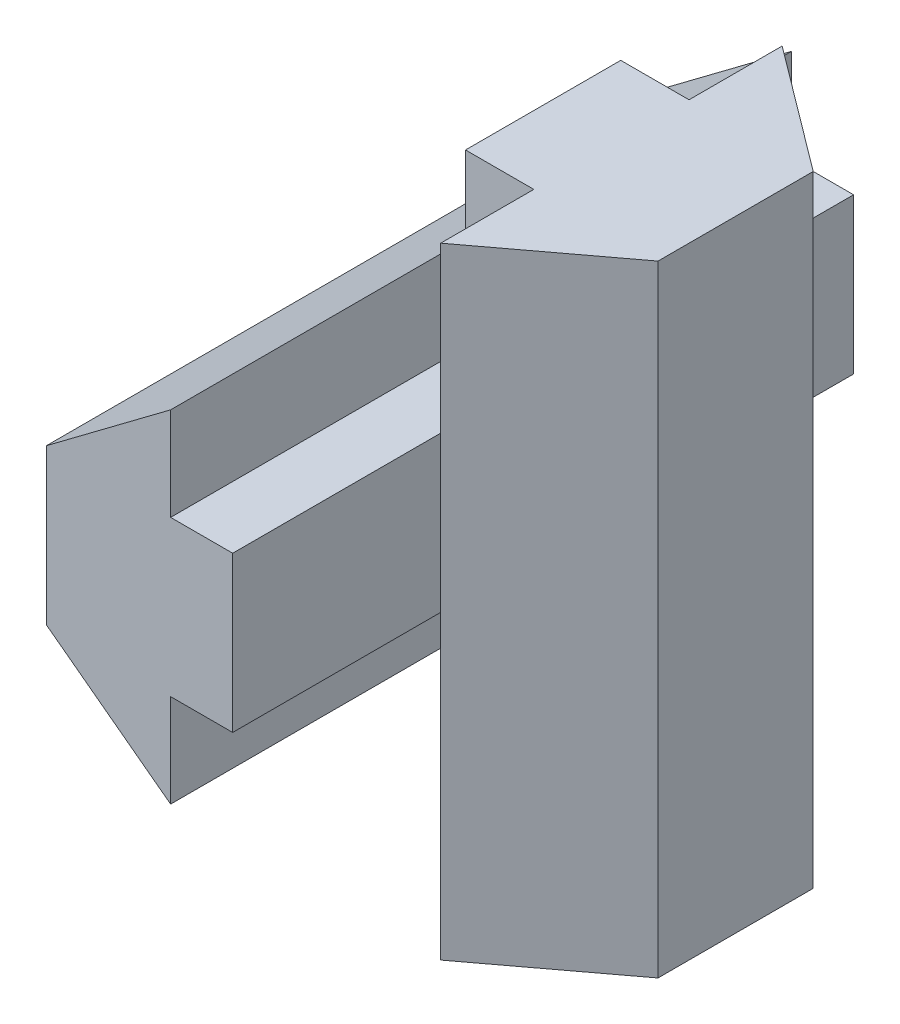
ISO-10303-21;
HEADER;
FILE_DESCRIPTION(('STEP AP214'),'2;1');
FILE_NAME('part.step','',(''),(''),'','','');
FILE_SCHEMA(('AUTOMOTIVE_DESIGN { 1 0 10303 214 1 1 1 1 }'));
ENDSEC;
DATA;
#1=APPLICATION_CONTEXT('core data for automotive mechanical design processes');
#2=APPLICATION_PROTOCOL_DEFINITION('international standard','automotive_design',2000,#1);
#3=PRODUCT_CONTEXT('',#1,'mechanical');
#4=PRODUCT('Part','Part','',(#3));
#5=PRODUCT_RELATED_PRODUCT_CATEGORY('part','',(#4));
#6=PRODUCT_DEFINITION_FORMATION('','',#4);
#7=PRODUCT_DEFINITION_CONTEXT('part definition',#1,'design');
#8=PRODUCT_DEFINITION('design','',#6,#7);
#9=PRODUCT_DEFINITION_SHAPE('','',#8);
#10=(LENGTH_UNIT() NAMED_UNIT(*) SI_UNIT(.MILLI.,.METRE.));
#11=(NAMED_UNIT(*) PLANE_ANGLE_UNIT() SI_UNIT($,.RADIAN.));
#12=(NAMED_UNIT(*) SI_UNIT($,.STERADIAN.) SOLID_ANGLE_UNIT());
#13=UNCERTAINTY_MEASURE_WITH_UNIT(LENGTH_MEASURE(1.E-05),#10,'distance_accuracy_value','');
#14=(GEOMETRIC_REPRESENTATION_CONTEXT(3) GLOBAL_UNCERTAINTY_ASSIGNED_CONTEXT((#13)) GLOBAL_UNIT_ASSIGNED_CONTEXT((#10,
#11,#12)) REPRESENTATION_CONTEXT('',''));
#15=CARTESIAN_POINT('',(0.,0.,0.));
#16=DIRECTION('',(0.,0.,1.));
#17=DIRECTION('',(1.,0.,0.));
#18=AXIS2_PLACEMENT_3D('',#15,#16,#17);
#19=CARTESIAN_POINT('',(6.,2.5,10.));
#20=DIRECTION('',(-1.,0.,0.));
#21=DIRECTION('',(0.,-1.,0.));
#22=AXIS2_PLACEMENT_3D('',#19,#20,#21);
#23=PLANE('',#22);
#24=DIRECTION('',(0.,-1.,0.));
#25=VECTOR('',#24,1.);
#26=CARTESIAN_POINT('',(6.,10.,2.5));
#27=LINE('',#26,#25);
#28=CARTESIAN_POINT('',(6.,2.5,2.5));
#29=VERTEX_POINT('',#28);
#30=CARTESIAN_POINT('',(6.,-2.5,2.5));
#31=VERTEX_POINT('',#30);
#32=EDGE_CURVE('E11',#29,#31,#27,.T.);
#33=ORIENTED_EDGE('',*,*,#32,.F.);
#34=DIRECTION('',(0.,0.,-1.));
#35=VECTOR('',#34,1.);
#36=CARTESIAN_POINT('',(6.,2.5,10.));
#37=LINE('',#36,#35);
#38=CARTESIAN_POINT('',(6.,2.5,10.));
#39=VERTEX_POINT('',#38);
#40=EDGE_CURVE('E168',#39,#29,#37,.T.);
#41=ORIENTED_EDGE('',*,*,#40,.F.);
#42=DIRECTION('',(0.,1.,0.));
#43=VECTOR('',#42,1.);
#44=CARTESIAN_POINT('',(6.,2.5,10.));
#45=LINE('',#44,#43);
#46=CARTESIAN_POINT('',(6.,-2.5,10.));
#47=VERTEX_POINT('',#46);
#48=EDGE_CURVE('E297',#47,#39,#45,.T.);
#49=ORIENTED_EDGE('',*,*,#48,.F.);
#50=DIRECTION('',(0.,0.,-1.));
#51=VECTOR('',#50,1.);
#52=CARTESIAN_POINT('',(6.,-2.5,10.));
#53=LINE('',#52,#51);
#54=EDGE_CURVE('E173',#47,#31,#53,.T.);
#55=ORIENTED_EDGE('',*,*,#54,.T.);
#56=EDGE_LOOP('',(#33,#41,#49,#55));
#57=FACE_BOUND('',#56,.T.);
#58=ADVANCED_FACE('F33',(#57),#23,.F.);
#59=CARTESIAN_POINT('',(0.,-2.5,10.));
#60=DIRECTION('',(0.6,0.8,0.));
#61=DIRECTION('',(-0.8,0.6,0.));
#62=AXIS2_PLACEMENT_3D('',#59,#60,#61);
#63=PLANE('',#62);
#64=DIRECTION('',(0.8,-0.6,0.));
#65=VECTOR('',#64,1.);
#66=CARTESIAN_POINT('',(0.,-2.5,-10.));
#67=LINE('',#66,#65);
#68=CARTESIAN_POINT('',(0.,-2.5,-10.));
#69=VERTEX_POINT('',#68);
#70=CARTESIAN_POINT('',(4.,-5.5,-10.));
#71=VERTEX_POINT('',#70);
#72=EDGE_CURVE('E146',#69,#71,#67,.T.);
#73=ORIENTED_EDGE('',*,*,#72,.T.);
#74=DIRECTION('',(0.,0.,-1.));
#75=VECTOR('',#74,1.);
#76=CARTESIAN_POINT('',(4.,-5.5,10.));
#77=LINE('',#76,#75);
#78=CARTESIAN_POINT('',(4.,-5.5,10.));
#79=VERTEX_POINT('',#78);
#80=EDGE_CURVE('E37',#79,#71,#77,.T.);
#81=ORIENTED_EDGE('',*,*,#80,.F.);
#82=DIRECTION('',(0.8,-0.6,0.));
#83=VECTOR('',#82,1.);
#84=CARTESIAN_POINT('',(0.,-2.5,10.));
#85=LINE('',#84,#83);
#86=CARTESIAN_POINT('',(0.,-2.5,10.));
#87=VERTEX_POINT('',#86);
#88=EDGE_CURVE('E163',#87,#79,#85,.T.);
#89=ORIENTED_EDGE('',*,*,#88,.F.);
#90=DIRECTION('',(0.,0.,-1.));
#91=VECTOR('',#90,1.);
#92=CARTESIAN_POINT('',(0.,-2.5,10.));
#93=LINE('',#92,#91);
#94=EDGE_CURVE('E142',#87,#69,#93,.T.);
#95=ORIENTED_EDGE('',*,*,#94,.T.);
#96=EDGE_LOOP('',(#73,#81,#89,#95));
#97=FACE_BOUND('',#96,.T.);
#98=ADVANCED_FACE('F35',(#97),#63,.F.);
#99=CARTESIAN_POINT('',(4.,-2.5,10.));
#100=DIRECTION('',(-1.,0.,0.));
#101=DIRECTION('',(0.,0.,1.));
#102=AXIS2_PLACEMENT_3D('',#99,#100,#101);
#103=PLANE('',#102);
#104=DIRECTION('',(0.,1.,0.));
#105=VECTOR('',#104,1.);
#106=CARTESIAN_POINT('',(4.,-2.5,-10.));
#107=LINE('',#106,#105);
#108=CARTESIAN_POINT('',(4.,-2.5,-10.));
#109=VERTEX_POINT('',#108);
#110=EDGE_CURVE('E149',#71,#109,#107,.T.);
#111=ORIENTED_EDGE('',*,*,#110,.T.);
#112=DIRECTION('',(0.,0.,-1.));
#113=VECTOR('',#112,1.);
#114=CARTESIAN_POINT('',(4.,-2.5,10.));
#115=LINE('',#114,#113);
#116=CARTESIAN_POINT('',(4.,-2.5,10.));
#117=VERTEX_POINT('',#116);
#118=EDGE_CURVE('E175',#117,#109,#115,.T.);
#119=ORIENTED_EDGE('',*,*,#118,.F.);
#120=DIRECTION('',(0.,1.,0.));
#121=VECTOR('',#120,1.);
#122=CARTESIAN_POINT('',(4.,-2.5,10.));
#123=LINE('',#122,#121);
#124=EDGE_CURVE('E103',#79,#117,#123,.T.);
#125=ORIENTED_EDGE('',*,*,#124,.F.);
#126=ORIENTED_EDGE('',*,*,#80,.T.);
#127=EDGE_LOOP('',(#111,#119,#125,#126));
#128=FACE_BOUND('',#127,.T.);
#129=ADVANCED_FACE('F312',(#128),#103,.F.);
#130=CARTESIAN_POINT('',(6.,-2.5,10.));
#131=DIRECTION('',(0.,1.,0.));
#132=DIRECTION('',(0.,0.,1.));
#133=AXIS2_PLACEMENT_3D('',#130,#131,#132);
#134=PLANE('',#133);
#135=DIRECTION('',(1.,0.,0.));
#136=VECTOR('',#135,1.);
#137=CARTESIAN_POINT('',(6.,-2.5,-10.));
#138=LINE('',#137,#136);
#139=CARTESIAN_POINT('',(6.,-2.5,-10.));
#140=VERTEX_POINT('',#139);
#141=EDGE_CURVE('E151',#109,#140,#138,.T.);
#142=ORIENTED_EDGE('',*,*,#141,.T.);
#143=CARTESIAN_POINT('',(6.,-2.5,-2.5));
#144=VERTEX_POINT('',#143);
#145=EDGE_CURVE('E171',#144,#140,#53,.T.);
#146=ORIENTED_EDGE('',*,*,#145,.F.);
#147=EDGE_CURVE('E176',#31,#144,#53,.T.);
#148=ORIENTED_EDGE('',*,*,#147,.F.);
#149=ORIENTED_EDGE('',*,*,#54,.F.);
#150=DIRECTION('',(1.,0.,0.));
#151=VECTOR('',#150,1.);
#152=CARTESIAN_POINT('',(6.,-2.5,10.));
#153=LINE('',#152,#151);
#154=EDGE_CURVE('E295',#117,#47,#153,.T.);
#155=ORIENTED_EDGE('',*,*,#154,.F.);
#156=ORIENTED_EDGE('',*,*,#118,.T.);
#157=EDGE_LOOP('',(#142,#146,#148,#149,#155,#156));
#158=FACE_BOUND('',#157,.T.);
#159=ADVANCED_FACE('F313',(#158),#134,.F.);
#160=CARTESIAN_POINT('',(6.,2.5,-2.5));
#161=VERTEX_POINT('',#160);
#162=CARTESIAN_POINT('',(6.,2.5,-10.));
#163=VERTEX_POINT('',#162);
#164=EDGE_CURVE('E167',#161,#163,#37,.T.);
#165=ORIENTED_EDGE('',*,*,#164,.F.);
#166=DIRECTION('',(0.,-1.,0.));
#167=VECTOR('',#166,1.);
#168=CARTESIAN_POINT('',(6.,10.,-2.5));
#169=LINE('',#168,#167);
#170=EDGE_CURVE('E42',#161,#144,#169,.T.);
#171=ORIENTED_EDGE('',*,*,#170,.T.);
#172=ORIENTED_EDGE('',*,*,#145,.T.);
#173=DIRECTION('',(0.,1.,0.));
#174=VECTOR('',#173,1.);
#175=CARTESIAN_POINT('',(6.,2.5,-10.));
#176=LINE('',#175,#174);
#177=EDGE_CURVE('E154',#140,#163,#176,.T.);
#178=ORIENTED_EDGE('',*,*,#177,.T.);
#179=EDGE_LOOP('',(#165,#171,#172,#178));
#180=FACE_BOUND('',#179,.T.);
#181=ADVANCED_FACE('F375',(#180),#23,.F.);
#182=CARTESIAN_POINT('',(4.,2.5,10.));
#183=DIRECTION('',(0.,-1.,0.));
#184=DIRECTION('',(0.,0.,-1.));
#185=AXIS2_PLACEMENT_3D('',#182,#183,#184);
#186=PLANE('',#185);
#187=DIRECTION('',(-1.,0.,0.));
#188=VECTOR('',#187,1.);
#189=CARTESIAN_POINT('',(4.,2.5,-10.));
#190=LINE('',#189,#188);
#191=CARTESIAN_POINT('',(4.,2.5,-10.));
#192=VERTEX_POINT('',#191);
#193=EDGE_CURVE('E157',#163,#192,#190,.T.);
#194=ORIENTED_EDGE('',*,*,#193,.T.);
#195=DIRECTION('',(0.,0.,-1.));
#196=VECTOR('',#195,1.);
#197=CARTESIAN_POINT('',(4.,2.5,10.));
#198=LINE('',#197,#196);
#199=CARTESIAN_POINT('',(4.,2.5,10.));
#200=VERTEX_POINT('',#199);
#201=EDGE_CURVE('E137',#200,#192,#198,.T.);
#202=ORIENTED_EDGE('',*,*,#201,.F.);
#203=DIRECTION('',(-1.,0.,0.));
#204=VECTOR('',#203,1.);
#205=CARTESIAN_POINT('',(4.,2.5,10.));
#206=LINE('',#205,#204);
#207=EDGE_CURVE('E125',#39,#200,#206,.T.);
#208=ORIENTED_EDGE('',*,*,#207,.F.);
#209=ORIENTED_EDGE('',*,*,#40,.T.);
#210=EDGE_CURVE('E172',#29,#161,#37,.T.);
#211=ORIENTED_EDGE('',*,*,#210,.T.);
#212=ORIENTED_EDGE('',*,*,#164,.T.);
#213=EDGE_LOOP('',(#194,#202,#208,#209,#211,#212));
#214=FACE_BOUND('',#213,.T.);
#215=ADVANCED_FACE('F303',(#214),#186,.F.);
#216=CARTESIAN_POINT('',(4.,5.5,10.));
#217=DIRECTION('',(-1.,0.,0.));
#218=DIRECTION('',(0.,0.,1.));
#219=AXIS2_PLACEMENT_3D('',#216,#217,#218);
#220=PLANE('',#219);
#221=DIRECTION('',(0.,1.,0.));
#222=VECTOR('',#221,1.);
#223=CARTESIAN_POINT('',(4.,5.5,-10.));
#224=LINE('',#223,#222);
#225=CARTESIAN_POINT('',(4.,5.5,-10.));
#226=VERTEX_POINT('',#225);
#227=EDGE_CURVE('E134',#192,#226,#224,.T.);
#228=ORIENTED_EDGE('',*,*,#227,.T.);
#229=DIRECTION('',(0.,0.,-1.));
#230=VECTOR('',#229,1.);
#231=CARTESIAN_POINT('',(4.,5.5,10.));
#232=LINE('',#231,#230);
#233=CARTESIAN_POINT('',(4.,5.5,10.));
#234=VERTEX_POINT('',#233);
#235=EDGE_CURVE('E131',#234,#226,#232,.T.);
#236=ORIENTED_EDGE('',*,*,#235,.F.);
#237=DIRECTION('',(0.,1.,0.));
#238=VECTOR('',#237,1.);
#239=CARTESIAN_POINT('',(4.,5.5,10.));
#240=LINE('',#239,#238);
#241=EDGE_CURVE('E118',#200,#234,#240,.T.);
#242=ORIENTED_EDGE('',*,*,#241,.F.);
#243=ORIENTED_EDGE('',*,*,#201,.T.);
#244=EDGE_LOOP('',(#228,#236,#242,#243));
#245=FACE_BOUND('',#244,.T.);
#246=ADVANCED_FACE('F132',(#245),#220,.F.);
#247=CARTESIAN_POINT('',(0.,2.5,10.));
#248=DIRECTION('',(0.6,-0.8,0.));
#249=DIRECTION('',(0.8,0.6,0.));
#250=AXIS2_PLACEMENT_3D('',#247,#248,#249);
#251=PLANE('',#250);
#252=DIRECTION('',(-0.8,-0.6,0.));
#253=VECTOR('',#252,1.);
#254=CARTESIAN_POINT('',(0.,2.5,-10.));
#255=LINE('',#254,#253);
#256=CARTESIAN_POINT('',(0.,2.5,-10.));
#257=VERTEX_POINT('',#256);
#258=EDGE_CURVE('E160',#226,#257,#255,.T.);
#259=ORIENTED_EDGE('',*,*,#258,.T.);
#260=DIRECTION('',(0.,0.,-1.));
#261=VECTOR('',#260,1.);
#262=CARTESIAN_POINT('',(0.,2.5,10.));
#263=LINE('',#262,#261);
#264=CARTESIAN_POINT('',(0.,2.5,10.));
#265=VERTEX_POINT('',#264);
#266=EDGE_CURVE('E138',#265,#257,#263,.T.);
#267=ORIENTED_EDGE('',*,*,#266,.F.);
#268=DIRECTION('',(-0.8,-0.6,0.));
#269=VECTOR('',#268,1.);
#270=CARTESIAN_POINT('',(0.,2.5,10.));
#271=LINE('',#270,#269);
#272=EDGE_CURVE('E122',#234,#265,#271,.T.);
#273=ORIENTED_EDGE('',*,*,#272,.F.);
#274=ORIENTED_EDGE('',*,*,#235,.T.);
#275=EDGE_LOOP('',(#259,#267,#273,#274));
#276=FACE_BOUND('',#275,.T.);
#277=ADVANCED_FACE('F140',(#276),#251,.F.);
#278=CARTESIAN_POINT('',(0.,-2.5,10.));
#279=DIRECTION('',(1.,0.,0.));
#280=DIRECTION('',(0.,0.,-1.));
#281=AXIS2_PLACEMENT_3D('',#278,#279,#280);
#282=PLANE('',#281);
#283=DIRECTION('',(0.,-1.,0.));
#284=VECTOR('',#283,1.);
#285=CARTESIAN_POINT('',(0.,-2.5,-10.));
#286=LINE('',#285,#284);
#287=EDGE_CURVE('E94',#257,#69,#286,.T.);
#288=ORIENTED_EDGE('',*,*,#287,.T.);
#289=ORIENTED_EDGE('',*,*,#94,.F.);
#290=DIRECTION('',(0.,-1.,0.));
#291=VECTOR('',#290,1.);
#292=CARTESIAN_POINT('',(0.,-2.5,10.));
#293=LINE('',#292,#291);
#294=EDGE_CURVE('E61',#265,#87,#293,.T.);
#295=ORIENTED_EDGE('',*,*,#294,.F.);
#296=ORIENTED_EDGE('',*,*,#266,.T.);
#297=EDGE_LOOP('',(#288,#289,#295,#296));
#298=FACE_BOUND('',#297,.T.);
#299=ADVANCED_FACE('F309',(#298),#282,.F.);
#300=CARTESIAN_POINT('',(0.,0.,10.));
#301=DIRECTION('',(0.,0.,1.));
#302=DIRECTION('',(1.,0.,0.));
#303=AXIS2_PLACEMENT_3D('',#300,#301,#302);
#304=PLANE('',#303);
#305=ORIENTED_EDGE('',*,*,#88,.T.);
#306=ORIENTED_EDGE('',*,*,#124,.T.);
#307=ORIENTED_EDGE('',*,*,#154,.T.);
#308=ORIENTED_EDGE('',*,*,#48,.T.);
#309=ORIENTED_EDGE('',*,*,#207,.T.);
#310=ORIENTED_EDGE('',*,*,#241,.T.);
#311=ORIENTED_EDGE('',*,*,#272,.T.);
#312=ORIENTED_EDGE('',*,*,#294,.T.);
#313=EDGE_LOOP('',(#305,#306,#307,#308,#309,#310,#311,#312));
#314=FACE_BOUND('',#313,.T.);
#315=ADVANCED_FACE('F120',(#314),#304,.T.);
#316=CARTESIAN_POINT('',(0.,0.,-10.));
#317=DIRECTION('',(0.,0.,1.));
#318=DIRECTION('',(1.,0.,0.));
#319=AXIS2_PLACEMENT_3D('',#316,#317,#318);
#320=PLANE('',#319);
#321=ORIENTED_EDGE('',*,*,#72,.F.);
#322=ORIENTED_EDGE('',*,*,#287,.F.);
#323=ORIENTED_EDGE('',*,*,#258,.F.);
#324=ORIENTED_EDGE('',*,*,#227,.F.);
#325=ORIENTED_EDGE('',*,*,#193,.F.);
#326=ORIENTED_EDGE('',*,*,#177,.F.);
#327=ORIENTED_EDGE('',*,*,#141,.F.);
#328=ORIENTED_EDGE('',*,*,#110,.F.);
#329=EDGE_LOOP('',(#321,#322,#323,#324,#325,#326,#327,#328));
#330=FACE_BOUND('',#329,.T.);
#331=ADVANCED_FACE('F307',(#330),#320,.F.);
#332=CARTESIAN_POINT('',(6.,10.,2.5));
#333=DIRECTION('',(1.,0.,0.));
#334=DIRECTION('',(0.,0.,-1.));
#335=AXIS2_PLACEMENT_3D('',#332,#333,#334);
#336=PLANE('',#335);
#337=CARTESIAN_POINT('',(6.,-10.,2.5));
#338=VERTEX_POINT('',#337);
#339=EDGE_CURVE('E45',#31,#338,#27,.T.);
#340=ORIENTED_EDGE('',*,*,#339,.F.);
#341=ORIENTED_EDGE('',*,*,#147,.T.);
#342=CARTESIAN_POINT('',(6.,-10.,-2.5));
#343=VERTEX_POINT('',#342);
#344=EDGE_CURVE('E52',#144,#343,#169,.T.);
#345=ORIENTED_EDGE('',*,*,#344,.T.);
#346=DIRECTION('',(0.,0.,1.));
#347=VECTOR('',#346,1.);
#348=CARTESIAN_POINT('',(6.,-10.,2.5));
#349=LINE('',#348,#347);
#350=EDGE_CURVE('E209',#343,#338,#349,.T.);
#351=ORIENTED_EDGE('',*,*,#350,.T.);
#352=EDGE_LOOP('',(#340,#341,#345,#351));
#353=FACE_BOUND('',#352,.T.);
#354=ADVANCED_FACE('F362',(#353),#336,.F.);
#355=ORIENTED_EDGE('',*,*,#210,.F.);
#356=CARTESIAN_POINT('',(6.,10.,2.5));
#357=VERTEX_POINT('',#356);
#358=EDGE_CURVE('E44',#357,#29,#27,.T.);
#359=ORIENTED_EDGE('',*,*,#358,.F.);
#360=DIRECTION('',(0.,0.,1.));
#361=VECTOR('',#360,1.);
#362=CARTESIAN_POINT('',(6.,10.,2.5));
#363=LINE('',#362,#361);
#364=CARTESIAN_POINT('',(6.,10.,-2.5));
#365=VERTEX_POINT('',#364);
#366=EDGE_CURVE('E229',#365,#357,#363,.T.);
#367=ORIENTED_EDGE('',*,*,#366,.F.);
#368=EDGE_CURVE('E184',#365,#161,#169,.T.);
#369=ORIENTED_EDGE('',*,*,#368,.T.);
#370=EDGE_LOOP('',(#355,#359,#367,#369));
#371=FACE_BOUND('',#370,.T.);
#372=ADVANCED_FACE('F280',(#371),#336,.F.);
#373=CARTESIAN_POINT('',(8.2,10.,2.5));
#374=DIRECTION('',(0.,0.,-1.));
#375=DIRECTION('',(-1.,0.,0.));
#376=AXIS2_PLACEMENT_3D('',#373,#374,#375);
#377=PLANE('',#376);
#378=DIRECTION('',(1.,0.,0.));
#379=VECTOR('',#378,1.);
#380=CARTESIAN_POINT('',(8.2,-10.,2.5));
#381=LINE('',#380,#379);
#382=CARTESIAN_POINT('',(8.2,-10.,2.5));
#383=VERTEX_POINT('',#382);
#384=EDGE_CURVE('E211',#338,#383,#381,.T.);
#385=ORIENTED_EDGE('',*,*,#384,.T.);
#386=DIRECTION('',(0.,-1.,0.));
#387=VECTOR('',#386,1.);
#388=CARTESIAN_POINT('',(8.2,10.,2.5));
#389=LINE('',#388,#387);
#390=CARTESIAN_POINT('',(8.2,10.,2.5));
#391=VERTEX_POINT('',#390);
#392=EDGE_CURVE('E289',#391,#383,#389,.T.);
#393=ORIENTED_EDGE('',*,*,#392,.F.);
#394=DIRECTION('',(1.,0.,0.));
#395=VECTOR('',#394,1.);
#396=CARTESIAN_POINT('',(8.2,10.,2.5));
#397=LINE('',#396,#395);
#398=EDGE_CURVE('E233',#357,#391,#397,.T.);
#399=ORIENTED_EDGE('',*,*,#398,.F.);
#400=ORIENTED_EDGE('',*,*,#358,.T.);
#401=ORIENTED_EDGE('',*,*,#32,.T.);
#402=ORIENTED_EDGE('',*,*,#339,.T.);
#403=EDGE_LOOP('',(#385,#393,#399,#400,#401,#402));
#404=FACE_BOUND('',#403,.T.);
#405=ADVANCED_FACE('F341',(#404),#377,.F.);
#406=CARTESIAN_POINT('',(8.2,10.,2.5));
#407=DIRECTION('',(1.,0.,0.));
#408=DIRECTION('',(0.,0.,-1.));
#409=AXIS2_PLACEMENT_3D('',#406,#407,#408);
#410=PLANE('',#409);
#411=DIRECTION('',(0.,0.,1.));
#412=VECTOR('',#411,1.);
#413=CARTESIAN_POINT('',(8.2,-10.,2.5));
#414=LINE('',#413,#412);
#415=CARTESIAN_POINT('',(8.2,-10.,5.5));
#416=VERTEX_POINT('',#415);
#417=EDGE_CURVE('E214',#383,#416,#414,.T.);
#418=ORIENTED_EDGE('',*,*,#417,.T.);
#419=DIRECTION('',(0.,-1.,0.));
#420=VECTOR('',#419,1.);
#421=CARTESIAN_POINT('',(8.2,10.,5.5));
#422=LINE('',#421,#420);
#423=CARTESIAN_POINT('',(8.2,10.,5.5));
#424=VERTEX_POINT('',#423);
#425=EDGE_CURVE('E345',#424,#416,#422,.T.);
#426=ORIENTED_EDGE('',*,*,#425,.F.);
#427=DIRECTION('',(0.,0.,1.));
#428=VECTOR('',#427,1.);
#429=CARTESIAN_POINT('',(8.2,10.,2.5));
#430=LINE('',#429,#428);
#431=EDGE_CURVE('E239',#391,#424,#430,.T.);
#432=ORIENTED_EDGE('',*,*,#431,.F.);
#433=ORIENTED_EDGE('',*,*,#392,.T.);
#434=EDGE_LOOP('',(#418,#426,#432,#433));
#435=FACE_BOUND('',#434,.T.);
#436=ADVANCED_FACE('F346',(#435),#410,.F.);
#437=CARTESIAN_POINT('',(8.2,10.,5.5));
#438=DIRECTION('',(-0.6,0.,-0.8));
#439=DIRECTION('',(-0.8,0.,0.6));
#440=AXIS2_PLACEMENT_3D('',#437,#438,#439);
#441=PLANE('',#440);
#442=DIRECTION('',(0.8,0.,-0.600000000000001));
#443=VECTOR('',#442,1.);
#444=CARTESIAN_POINT('',(8.2,-10.,5.5));
#445=LINE('',#444,#443);
#446=CARTESIAN_POINT('',(12.2,-10.,2.5));
#447=VERTEX_POINT('',#446);
#448=EDGE_CURVE('E217',#416,#447,#445,.T.);
#449=ORIENTED_EDGE('',*,*,#448,.T.);
#450=DIRECTION('',(0.,-1.,0.));
#451=VECTOR('',#450,1.);
#452=CARTESIAN_POINT('',(12.2,10.,2.5));
#453=LINE('',#452,#451);
#454=CARTESIAN_POINT('',(12.2,10.,2.5));
#455=VERTEX_POINT('',#454);
#456=EDGE_CURVE('E351',#455,#447,#453,.T.);
#457=ORIENTED_EDGE('',*,*,#456,.F.);
#458=DIRECTION('',(0.8,0.,-0.600000000000001));
#459=VECTOR('',#458,1.);
#460=CARTESIAN_POINT('',(8.2,10.,5.5));
#461=LINE('',#460,#459);
#462=EDGE_CURVE('E244',#424,#455,#461,.T.);
#463=ORIENTED_EDGE('',*,*,#462,.F.);
#464=ORIENTED_EDGE('',*,*,#425,.T.);
#465=EDGE_LOOP('',(#449,#457,#463,#464));
#466=FACE_BOUND('',#465,.T.);
#467=ADVANCED_FACE('F353',(#466),#441,.F.);
#468=CARTESIAN_POINT('',(12.2,10.,-2.5));
#469=DIRECTION('',(-1.,0.,0.));
#470=DIRECTION('',(0.,0.,1.));
#471=AXIS2_PLACEMENT_3D('',#468,#469,#470);
#472=PLANE('',#471);
#473=DIRECTION('',(0.,0.,-1.));
#474=VECTOR('',#473,1.);
#475=CARTESIAN_POINT('',(12.2,-10.,-2.5));
#476=LINE('',#475,#474);
#477=CARTESIAN_POINT('',(12.2,-10.,-2.5));
#478=VERTEX_POINT('',#477);
#479=EDGE_CURVE('E220',#447,#478,#476,.T.);
#480=ORIENTED_EDGE('',*,*,#479,.T.);
#481=DIRECTION('',(0.,-1.,0.));
#482=VECTOR('',#481,1.);
#483=CARTESIAN_POINT('',(12.2,10.,-2.5));
#484=LINE('',#483,#482);
#485=CARTESIAN_POINT('',(12.2,10.,-2.5));
#486=VERTEX_POINT('',#485);
#487=EDGE_CURVE('E270',#486,#478,#484,.T.);
#488=ORIENTED_EDGE('',*,*,#487,.F.);
#489=DIRECTION('',(0.,0.,-1.));
#490=VECTOR('',#489,1.);
#491=CARTESIAN_POINT('',(12.2,10.,-2.5));
#492=LINE('',#491,#490);
#493=EDGE_CURVE('E247',#455,#486,#492,.T.);
#494=ORIENTED_EDGE('',*,*,#493,.F.);
#495=ORIENTED_EDGE('',*,*,#456,.T.);
#496=EDGE_LOOP('',(#480,#488,#494,#495));
#497=FACE_BOUND('',#496,.T.);
#498=ADVANCED_FACE('F358',(#497),#472,.F.);
#499=CARTESIAN_POINT('',(8.2,10.,-5.5));
#500=DIRECTION('',(-0.6,0.,0.8));
#501=DIRECTION('',(0.8,0.,0.6));
#502=AXIS2_PLACEMENT_3D('',#499,#500,#501);
#503=PLANE('',#502);
#504=DIRECTION('',(-0.8,0.,-0.600000000000001));
#505=VECTOR('',#504,1.);
#506=CARTESIAN_POINT('',(8.2,-10.,-5.5));
#507=LINE('',#506,#505);
#508=CARTESIAN_POINT('',(8.2,-10.,-5.5));
#509=VERTEX_POINT('',#508);
#510=EDGE_CURVE('E223',#478,#509,#507,.T.);
#511=ORIENTED_EDGE('',*,*,#510,.T.);
#512=DIRECTION('',(0.,-1.,0.));
#513=VECTOR('',#512,1.);
#514=CARTESIAN_POINT('',(8.2,10.,-5.5));
#515=LINE('',#514,#513);
#516=CARTESIAN_POINT('',(8.2,10.,-5.5));
#517=VERTEX_POINT('',#516);
#518=EDGE_CURVE('E264',#517,#509,#515,.T.);
#519=ORIENTED_EDGE('',*,*,#518,.F.);
#520=DIRECTION('',(-0.8,0.,-0.600000000000001));
#521=VECTOR('',#520,1.);
#522=CARTESIAN_POINT('',(8.2,10.,-5.5));
#523=LINE('',#522,#521);
#524=EDGE_CURVE('E205',#486,#517,#523,.T.);
#525=ORIENTED_EDGE('',*,*,#524,.F.);
#526=ORIENTED_EDGE('',*,*,#487,.T.);
#527=EDGE_LOOP('',(#511,#519,#525,#526));
#528=FACE_BOUND('',#527,.T.);
#529=ADVANCED_FACE('F265',(#528),#503,.F.);
#530=CARTESIAN_POINT('',(8.2,10.,-2.5));
#531=DIRECTION('',(1.,0.,0.));
#532=DIRECTION('',(0.,0.,-1.));
#533=AXIS2_PLACEMENT_3D('',#530,#531,#532);
#534=PLANE('',#533);
#535=DIRECTION('',(0.,0.,1.));
#536=VECTOR('',#535,1.);
#537=CARTESIAN_POINT('',(8.2,-10.,-2.5));
#538=LINE('',#537,#536);
#539=CARTESIAN_POINT('',(8.2,-10.,-2.5));
#540=VERTEX_POINT('',#539);
#541=EDGE_CURVE('E226',#509,#540,#538,.T.);
#542=ORIENTED_EDGE('',*,*,#541,.T.);
#543=DIRECTION('',(0.,-1.,0.));
#544=VECTOR('',#543,1.);
#545=CARTESIAN_POINT('',(8.2,10.,-2.5));
#546=LINE('',#545,#544);
#547=CARTESIAN_POINT('',(8.2,10.,-2.5));
#548=VERTEX_POINT('',#547);
#549=EDGE_CURVE('E191',#548,#540,#546,.T.);
#550=ORIENTED_EDGE('',*,*,#549,.F.);
#551=DIRECTION('',(0.,0.,1.));
#552=VECTOR('',#551,1.);
#553=CARTESIAN_POINT('',(8.2,10.,-2.5));
#554=LINE('',#553,#552);
#555=EDGE_CURVE('E197',#517,#548,#554,.T.);
#556=ORIENTED_EDGE('',*,*,#555,.F.);
#557=ORIENTED_EDGE('',*,*,#518,.T.);
#558=EDGE_LOOP('',(#542,#550,#556,#557));
#559=FACE_BOUND('',#558,.T.);
#560=ADVANCED_FACE('F272',(#559),#534,.F.);
#561=CARTESIAN_POINT('',(6.,10.,-2.5));
#562=DIRECTION('',(0.,0.,1.));
#563=DIRECTION('',(1.,0.,0.));
#564=AXIS2_PLACEMENT_3D('',#561,#562,#563);
#565=PLANE('',#564);
#566=DIRECTION('',(-1.,0.,0.));
#567=VECTOR('',#566,1.);
#568=CARTESIAN_POINT('',(6.,-10.,-2.5));
#569=LINE('',#568,#567);
#570=EDGE_CURVE('E228',#540,#343,#569,.T.);
#571=ORIENTED_EDGE('',*,*,#570,.T.);
#572=ORIENTED_EDGE('',*,*,#344,.F.);
#573=ORIENTED_EDGE('',*,*,#170,.F.);
#574=ORIENTED_EDGE('',*,*,#368,.F.);
#575=DIRECTION('',(-1.,0.,0.));
#576=VECTOR('',#575,1.);
#577=CARTESIAN_POINT('',(6.,10.,-2.5));
#578=LINE('',#577,#576);
#579=EDGE_CURVE('E192',#548,#365,#578,.T.);
#580=ORIENTED_EDGE('',*,*,#579,.F.);
#581=ORIENTED_EDGE('',*,*,#549,.T.);
#582=EDGE_LOOP('',(#571,#572,#573,#574,#580,#581));
#583=FACE_BOUND('',#582,.T.);
#584=ADVANCED_FACE('F275',(#583),#565,.F.);
#585=CARTESIAN_POINT('',(0.,10.,0.));
#586=DIRECTION('',(0.,-1.,0.));
#587=DIRECTION('',(0.,0.,-1.));
#588=AXIS2_PLACEMENT_3D('',#585,#586,#587);
#589=PLANE('',#588);
#590=ORIENTED_EDGE('',*,*,#366,.T.);
#591=ORIENTED_EDGE('',*,*,#398,.T.);
#592=ORIENTED_EDGE('',*,*,#431,.T.);
#593=ORIENTED_EDGE('',*,*,#462,.T.);
#594=ORIENTED_EDGE('',*,*,#493,.T.);
#595=ORIENTED_EDGE('',*,*,#524,.T.);
#596=ORIENTED_EDGE('',*,*,#555,.T.);
#597=ORIENTED_EDGE('',*,*,#579,.T.);
#598=EDGE_LOOP('',(#590,#591,#592,#593,#594,#595,#596,#597));
#599=FACE_BOUND('',#598,.T.);
#600=ADVANCED_FACE('F253',(#599),#589,.F.);
#601=CARTESIAN_POINT('',(0.,-10.,0.));
#602=DIRECTION('',(0.,-1.,0.));
#603=DIRECTION('',(0.,0.,-1.));
#604=AXIS2_PLACEMENT_3D('',#601,#602,#603);
#605=PLANE('',#604);
#606=ORIENTED_EDGE('',*,*,#350,.F.);
#607=ORIENTED_EDGE('',*,*,#570,.F.);
#608=ORIENTED_EDGE('',*,*,#541,.F.);
#609=ORIENTED_EDGE('',*,*,#510,.F.);
#610=ORIENTED_EDGE('',*,*,#479,.F.);
#611=ORIENTED_EDGE('',*,*,#448,.F.);
#612=ORIENTED_EDGE('',*,*,#417,.F.);
#613=ORIENTED_EDGE('',*,*,#384,.F.);
#614=EDGE_LOOP('',(#606,#607,#608,#609,#610,#611,#612,#613));
#615=FACE_BOUND('',#614,.T.);
#616=ADVANCED_FACE('F361',(#615),#605,.T.);
#617=CLOSED_SHELL('',(#58,#98,#129,#159,#181,#215,#246,#277,#299,#315,#331,#354,#372,#405,#436,
#467,#498,#529,#560,#584,#600,#616));
#618=MANIFOLD_SOLID_BREP('B2',#617);
#619=ADVANCED_BREP_SHAPE_REPRESENTATION('',(#18,#618),#14);
#620=SHAPE_DEFINITION_REPRESENTATION(#9,#619);
ENDSEC;
END-ISO-10303-21;
